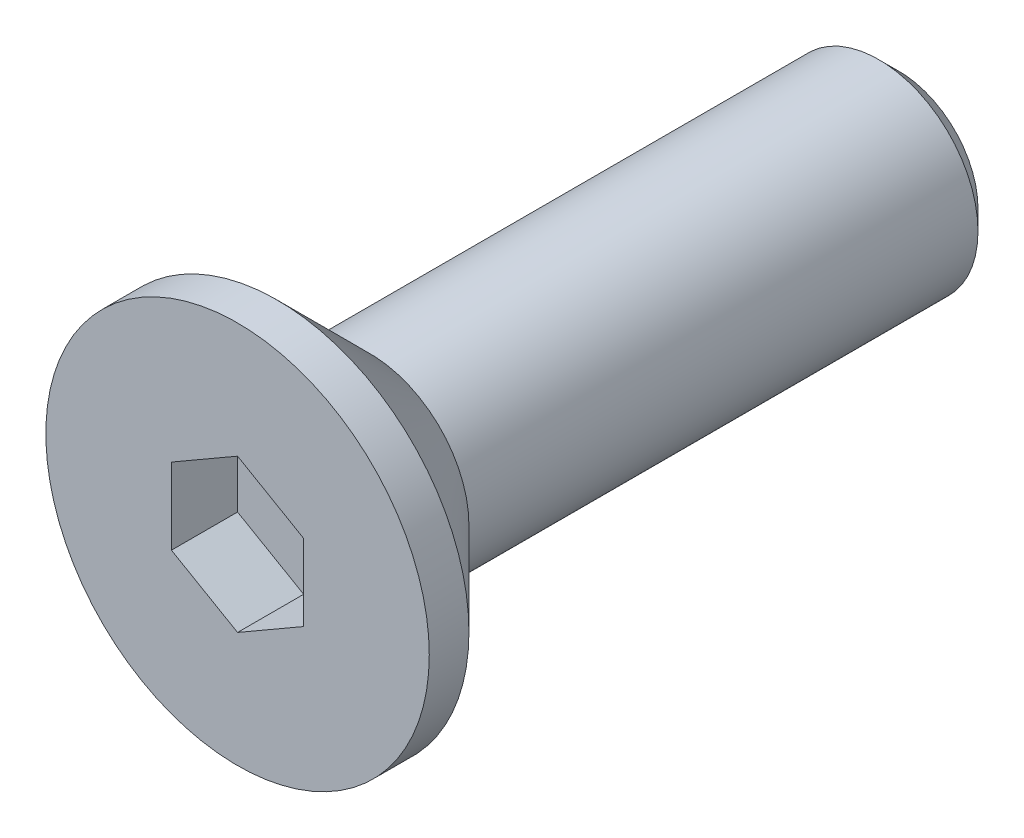
ISO-10303-21;
HEADER;
FILE_DESCRIPTION(('STEP AP214'),'2;1');
FILE_NAME('part.step','',(''),(''),'','','');
FILE_SCHEMA(('AUTOMOTIVE_DESIGN { 1 0 10303 214 1 1 1 1 }'));
ENDSEC;
DATA;
#1=APPLICATION_CONTEXT('core data for automotive mechanical design processes');
#2=APPLICATION_PROTOCOL_DEFINITION('international standard','automotive_design',2000,#1);
#3=PRODUCT_CONTEXT('',#1,'mechanical');
#4=PRODUCT('Part','Part','',(#3));
#5=PRODUCT_RELATED_PRODUCT_CATEGORY('part','',(#4));
#6=PRODUCT_DEFINITION_FORMATION('','',#4);
#7=PRODUCT_DEFINITION_CONTEXT('part definition',#1,'design');
#8=PRODUCT_DEFINITION('design','',#6,#7);
#9=PRODUCT_DEFINITION_SHAPE('','',#8);
#10=(LENGTH_UNIT() NAMED_UNIT(*) SI_UNIT(.MILLI.,.METRE.));
#11=(NAMED_UNIT(*) PLANE_ANGLE_UNIT() SI_UNIT($,.RADIAN.));
#12=(NAMED_UNIT(*) SI_UNIT($,.STERADIAN.) SOLID_ANGLE_UNIT());
#13=UNCERTAINTY_MEASURE_WITH_UNIT(LENGTH_MEASURE(1.E-05),#10,'distance_accuracy_value','');
#14=(GEOMETRIC_REPRESENTATION_CONTEXT(3) GLOBAL_UNCERTAINTY_ASSIGNED_CONTEXT((#13)) GLOBAL_UNIT_ASSIGNED_CONTEXT((#10,
#11,#12)) REPRESENTATION_CONTEXT('',''));
#15=CARTESIAN_POINT('',(0.,0.,0.));
#16=DIRECTION('',(0.,0.,1.));
#17=DIRECTION('',(1.,0.,0.));
#18=AXIS2_PLACEMENT_3D('',#15,#16,#17);
#19=CARTESIAN_POINT('',(0.,0.,0.));
#20=DIRECTION('',(0.,0.,-1.));
#21=DIRECTION('',(-1.,0.,0.));
#22=AXIS2_PLACEMENT_3D('',#19,#20,#21);
#23=PLANE('',#22);
#24=DIRECTION('',(0.,1.,0.));
#25=VECTOR('',#24,1.);
#26=CARTESIAN_POINT('',(1.,-0.577350269189626,0.));
#27=LINE('',#26,#25);
#28=CARTESIAN_POINT('',(1.,-0.577350269189626,0.));
#29=VERTEX_POINT('',#28);
#30=CARTESIAN_POINT('',(1.,0.577350269189626,0.));
#31=VERTEX_POINT('',#30);
#32=EDGE_CURVE('E128',#29,#31,#27,.T.);
#33=ORIENTED_EDGE('',*,*,#32,.F.);
#34=DIRECTION('',(0.866025403784439,0.5,0.));
#35=VECTOR('',#34,1.);
#36=CARTESIAN_POINT('',(0.,-1.15470053837925,0.));
#37=LINE('',#36,#35);
#38=CARTESIAN_POINT('',(0.,-1.15470053837925,0.));
#39=VERTEX_POINT('',#38);
#40=EDGE_CURVE('E54',#39,#29,#37,.T.);
#41=ORIENTED_EDGE('',*,*,#40,.F.);
#42=DIRECTION('',(0.866025403784439,-0.5,0.));
#43=VECTOR('',#42,1.);
#44=CARTESIAN_POINT('',(-1.,-0.577350269189626,0.));
#45=LINE('',#44,#43);
#46=CARTESIAN_POINT('',(-1.,-0.577350269189626,0.));
#47=VERTEX_POINT('',#46);
#48=EDGE_CURVE('E137',#47,#39,#45,.T.);
#49=ORIENTED_EDGE('',*,*,#48,.F.);
#50=DIRECTION('',(0.,-1.,0.));
#51=VECTOR('',#50,1.);
#52=CARTESIAN_POINT('',(-1.,0.577350269189626,0.));
#53=LINE('',#52,#51);
#54=CARTESIAN_POINT('',(-1.,0.577350269189626,0.));
#55=VERTEX_POINT('',#54);
#56=EDGE_CURVE('E135',#55,#47,#53,.T.);
#57=ORIENTED_EDGE('',*,*,#56,.F.);
#58=DIRECTION('',(-0.866025403784439,-0.5,0.));
#59=VECTOR('',#58,1.);
#60=CARTESIAN_POINT('',(0.,1.15470053837925,0.));
#61=LINE('',#60,#59);
#62=CARTESIAN_POINT('',(0.,1.15470053837925,0.));
#63=VERTEX_POINT('',#62);
#64=EDGE_CURVE('E102',#63,#55,#61,.T.);
#65=ORIENTED_EDGE('',*,*,#64,.F.);
#66=DIRECTION('',(-0.866025403784439,0.5,0.));
#67=VECTOR('',#66,1.);
#68=CARTESIAN_POINT('',(1.,0.577350269189626,0.));
#69=LINE('',#68,#67);
#70=EDGE_CURVE('E131',#31,#63,#69,.T.);
#71=ORIENTED_EDGE('',*,*,#70,.F.);
#72=EDGE_LOOP('',(#33,#41,#49,#57,#65,#71));
#73=FACE_BOUND('',#72,.T.);
#74=CARTESIAN_POINT('',(0.,0.,0.));
#75=DIRECTION('',(0.,0.,1.));
#76=DIRECTION('',(1.,0.,0.));
#77=AXIS2_PLACEMENT_3D('',#74,#75,#76);
#78=CIRCLE('',#77,2.9);
#79=CARTESIAN_POINT('',(2.9,0.,0.));
#80=VERTEX_POINT('',#79);
#81=EDGE_CURVE('E152',#80,#80,#78,.T.);
#82=ORIENTED_EDGE('',*,*,#81,.T.);
#83=EDGE_LOOP('',(#82));
#84=FACE_BOUND('',#83,.T.);
#85=ADVANCED_FACE('F39',(#73,#84),#23,.F.);
#86=CARTESIAN_POINT('',(0.,0.,31.7635815070186));
#87=DIRECTION('',(0.,0.,1.));
#88=DIRECTION('',(1.,0.,0.));
#89=AXIS2_PLACEMENT_3D('',#86,#87,#88);
#90=CYLINDRICAL_SURFACE('',#89,2.9);
#91=ORIENTED_EDGE('',*,*,#81,.F.);
#92=EDGE_LOOP('',(#91));
#93=FACE_BOUND('',#92,.T.);
#94=CARTESIAN_POINT('',(0.,0.,-0.60000000000001));
#95=DIRECTION('',(0.,0.,1.));
#96=DIRECTION('',(1.,0.,0.));
#97=AXIS2_PLACEMENT_3D('',#94,#95,#96);
#98=CIRCLE('',#97,2.9);
#99=CARTESIAN_POINT('',(2.9,0.,-0.60000000000001));
#100=VERTEX_POINT('',#99);
#101=EDGE_CURVE('E149',#100,#100,#98,.T.);
#102=ORIENTED_EDGE('',*,*,#101,.T.);
#103=EDGE_LOOP('',(#102));
#104=FACE_BOUND('',#103,.T.);
#105=ADVANCED_FACE('F169',(#93,#104),#90,.T.);
#106=CARTESIAN_POINT('',(0.,0.,-2.));
#107=DIRECTION('',(0.,0.,1.));
#108=DIRECTION('',(1.,0.,0.));
#109=AXIS2_PLACEMENT_3D('',#106,#107,#108);
#110=CONICAL_SURFACE('',#109,1.5,0.785398163397451);
#111=ORIENTED_EDGE('',*,*,#101,.F.);
#112=EDGE_LOOP('',(#111));
#113=FACE_BOUND('',#112,.T.);
#114=CARTESIAN_POINT('',(0.,0.,-2.));
#115=DIRECTION('',(0.,0.,1.));
#116=DIRECTION('',(1.,0.,0.));
#117=AXIS2_PLACEMENT_3D('',#114,#115,#116);
#118=CIRCLE('',#117,1.5);
#119=CARTESIAN_POINT('',(1.5,0.,-2.));
#120=VERTEX_POINT('',#119);
#121=EDGE_CURVE('E141',#120,#120,#118,.T.);
#122=ORIENTED_EDGE('',*,*,#121,.T.);
#123=EDGE_LOOP('',(#122));
#124=FACE_BOUND('',#123,.T.);
#125=ADVANCED_FACE('F174',(#113,#124),#110,.T.);
#126=CARTESIAN_POINT('',(0.,0.,31.7635815070186));
#127=DIRECTION('',(0.,0.,1.));
#128=DIRECTION('',(1.,0.,0.));
#129=AXIS2_PLACEMENT_3D('',#126,#127,#128);
#130=CYLINDRICAL_SURFACE('',#129,1.5);
#131=CARTESIAN_POINT('',(0.,0.,-9.7));
#132=DIRECTION('',(0.,0.,1.));
#133=DIRECTION('',(1.,0.,0.));
#134=AXIS2_PLACEMENT_3D('',#131,#132,#133);
#135=CIRCLE('',#134,1.5);
#136=CARTESIAN_POINT('',(1.5,0.,-9.7));
#137=VERTEX_POINT('',#136);
#138=EDGE_CURVE('E47',#137,#137,#135,.T.);
#139=ORIENTED_EDGE('',*,*,#138,.T.);
#140=EDGE_LOOP('',(#139));
#141=FACE_BOUND('',#140,.T.);
#142=ORIENTED_EDGE('',*,*,#121,.F.);
#143=EDGE_LOOP('',(#142));
#144=FACE_BOUND('',#143,.T.);
#145=ADVANCED_FACE('F157',(#141,#144),#130,.T.);
#146=CARTESIAN_POINT('',(0.,1.5,-10.));
#147=DIRECTION('',(0.,0.,1.));
#148=DIRECTION('',(1.,0.,0.));
#149=AXIS2_PLACEMENT_3D('',#146,#147,#148);
#150=PLANE('',#149);
#151=CARTESIAN_POINT('',(0.,0.,-10.));
#152=DIRECTION('',(0.,0.,1.));
#153=DIRECTION('',(1.,0.,0.));
#154=AXIS2_PLACEMENT_3D('',#151,#152,#153);
#155=CIRCLE('',#154,1.19999999999999);
#156=CARTESIAN_POINT('',(1.19999999999999,0.,-10.));
#157=VERTEX_POINT('',#156);
#158=EDGE_CURVE('E11',#157,#157,#155,.F.);
#159=ORIENTED_EDGE('',*,*,#158,.T.);
#160=EDGE_LOOP('',(#159));
#161=FACE_BOUND('',#160,.T.);
#162=ADVANCED_FACE('F185',(#161),#150,.F.);
#163=CARTESIAN_POINT('',(0.,-1.15470053837925,-1.));
#164=DIRECTION('',(0.5,-0.866025403784439,0.));
#165=DIRECTION('',(0.866025403784439,0.5,0.));
#166=AXIS2_PLACEMENT_3D('',#163,#164,#165);
#167=PLANE('',#166);
#168=ORIENTED_EDGE('',*,*,#40,.T.);
#169=DIRECTION('',(0.,0.,1.));
#170=VECTOR('',#169,1.);
#171=CARTESIAN_POINT('',(1.,-0.577350269189626,-1.));
#172=LINE('',#171,#170);
#173=CARTESIAN_POINT('',(1.,-0.577350269189626,-1.));
#174=VERTEX_POINT('',#173);
#175=EDGE_CURVE('E84',#174,#29,#172,.T.);
#176=ORIENTED_EDGE('',*,*,#175,.F.);
#177=DIRECTION('',(0.866025403784439,0.5,0.));
#178=VECTOR('',#177,1.);
#179=CARTESIAN_POINT('',(0.,-1.15470053837925,-1.));
#180=LINE('',#179,#178);
#181=CARTESIAN_POINT('',(0.,-1.15470053837925,-1.));
#182=VERTEX_POINT('',#181);
#183=EDGE_CURVE('E139',#182,#174,#180,.T.);
#184=ORIENTED_EDGE('',*,*,#183,.F.);
#185=DIRECTION('',(0.,0.,1.));
#186=VECTOR('',#185,1.);
#187=CARTESIAN_POINT('',(0.,-1.15470053837925,-1.));
#188=LINE('',#187,#186);
#189=EDGE_CURVE('E62',#182,#39,#188,.T.);
#190=ORIENTED_EDGE('',*,*,#189,.T.);
#191=EDGE_LOOP('',(#168,#176,#184,#190));
#192=FACE_BOUND('',#191,.T.);
#193=ADVANCED_FACE('F188',(#192),#167,.F.);
#194=CARTESIAN_POINT('',(-1.,-0.577350269189626,-1.));
#195=DIRECTION('',(-0.5,-0.866025403784439,0.));
#196=DIRECTION('',(0.866025403784439,-0.5,0.));
#197=AXIS2_PLACEMENT_3D('',#194,#195,#196);
#198=PLANE('',#197);
#199=ORIENTED_EDGE('',*,*,#48,.T.);
#200=ORIENTED_EDGE('',*,*,#189,.F.);
#201=DIRECTION('',(0.866025403784439,-0.5,0.));
#202=VECTOR('',#201,1.);
#203=CARTESIAN_POINT('',(-1.,-0.577350269189626,-1.));
#204=LINE('',#203,#202);
#205=CARTESIAN_POINT('',(-1.,-0.577350269189626,-1.));
#206=VERTEX_POINT('',#205);
#207=EDGE_CURVE('E114',#206,#182,#204,.T.);
#208=ORIENTED_EDGE('',*,*,#207,.F.);
#209=DIRECTION('',(0.,0.,1.));
#210=VECTOR('',#209,1.);
#211=CARTESIAN_POINT('',(-1.,-0.577350269189626,-1.));
#212=LINE('',#211,#210);
#213=EDGE_CURVE('E106',#206,#47,#212,.T.);
#214=ORIENTED_EDGE('',*,*,#213,.T.);
#215=EDGE_LOOP('',(#199,#200,#208,#214));
#216=FACE_BOUND('',#215,.T.);
#217=ADVANCED_FACE('F192',(#216),#198,.F.);
#218=CARTESIAN_POINT('',(-1.,0.577350269189626,-1.));
#219=DIRECTION('',(-1.,0.,0.));
#220=DIRECTION('',(0.,-1.,0.));
#221=AXIS2_PLACEMENT_3D('',#218,#219,#220);
#222=PLANE('',#221);
#223=ORIENTED_EDGE('',*,*,#56,.T.);
#224=ORIENTED_EDGE('',*,*,#213,.F.);
#225=DIRECTION('',(0.,-1.,0.));
#226=VECTOR('',#225,1.);
#227=CARTESIAN_POINT('',(-1.,0.577350269189626,-1.));
#228=LINE('',#227,#226);
#229=CARTESIAN_POINT('',(-1.,0.577350269189626,-1.));
#230=VERTEX_POINT('',#229);
#231=EDGE_CURVE('E110',#230,#206,#228,.T.);
#232=ORIENTED_EDGE('',*,*,#231,.F.);
#233=DIRECTION('',(0.,0.,1.));
#234=VECTOR('',#233,1.);
#235=CARTESIAN_POINT('',(-1.,0.577350269189626,-1.));
#236=LINE('',#235,#234);
#237=EDGE_CURVE('E95',#230,#55,#236,.T.);
#238=ORIENTED_EDGE('',*,*,#237,.T.);
#239=EDGE_LOOP('',(#223,#224,#232,#238));
#240=FACE_BOUND('',#239,.T.);
#241=ADVANCED_FACE('F111',(#240),#222,.F.);
#242=CARTESIAN_POINT('',(0.,1.15470053837925,-1.));
#243=DIRECTION('',(-0.5,0.866025403784439,0.));
#244=DIRECTION('',(-0.866025403784439,-0.5,0.));
#245=AXIS2_PLACEMENT_3D('',#242,#243,#244);
#246=PLANE('',#245);
#247=ORIENTED_EDGE('',*,*,#64,.T.);
#248=ORIENTED_EDGE('',*,*,#237,.F.);
#249=DIRECTION('',(-0.866025403784439,-0.5,0.));
#250=VECTOR('',#249,1.);
#251=CARTESIAN_POINT('',(0.,1.15470053837925,-1.));
#252=LINE('',#251,#250);
#253=CARTESIAN_POINT('',(0.,1.15470053837925,-1.));
#254=VERTEX_POINT('',#253);
#255=EDGE_CURVE('E99',#254,#230,#252,.T.);
#256=ORIENTED_EDGE('',*,*,#255,.F.);
#257=DIRECTION('',(0.,0.,1.));
#258=VECTOR('',#257,1.);
#259=CARTESIAN_POINT('',(0.,1.15470053837925,-1.));
#260=LINE('',#259,#258);
#261=EDGE_CURVE('E107',#254,#63,#260,.T.);
#262=ORIENTED_EDGE('',*,*,#261,.T.);
#263=EDGE_LOOP('',(#247,#248,#256,#262));
#264=FACE_BOUND('',#263,.T.);
#265=ADVANCED_FACE('F97',(#264),#246,.F.);
#266=CARTESIAN_POINT('',(1.,0.577350269189626,-1.));
#267=DIRECTION('',(0.5,0.866025403784439,0.));
#268=DIRECTION('',(-0.866025403784439,0.5,0.));
#269=AXIS2_PLACEMENT_3D('',#266,#267,#268);
#270=PLANE('',#269);
#271=ORIENTED_EDGE('',*,*,#70,.T.);
#272=ORIENTED_EDGE('',*,*,#261,.F.);
#273=DIRECTION('',(-0.866025403784439,0.5,0.));
#274=VECTOR('',#273,1.);
#275=CARTESIAN_POINT('',(1.,0.577350269189626,-1.));
#276=LINE('',#275,#274);
#277=CARTESIAN_POINT('',(1.,0.577350269189626,-1.));
#278=VERTEX_POINT('',#277);
#279=EDGE_CURVE('E120',#278,#254,#276,.T.);
#280=ORIENTED_EDGE('',*,*,#279,.F.);
#281=DIRECTION('',(0.,0.,1.));
#282=VECTOR('',#281,1.);
#283=CARTESIAN_POINT('',(1.,0.577350269189626,-1.));
#284=LINE('',#283,#282);
#285=EDGE_CURVE('E144',#278,#31,#284,.T.);
#286=ORIENTED_EDGE('',*,*,#285,.T.);
#287=EDGE_LOOP('',(#271,#272,#280,#286));
#288=FACE_BOUND('',#287,.T.);
#289=ADVANCED_FACE('F195',(#288),#270,.F.);
#290=CARTESIAN_POINT('',(1.,-0.577350269189626,-1.));
#291=DIRECTION('',(1.,0.,0.));
#292=DIRECTION('',(0.,1.,0.));
#293=AXIS2_PLACEMENT_3D('',#290,#291,#292);
#294=PLANE('',#293);
#295=ORIENTED_EDGE('',*,*,#32,.T.);
#296=ORIENTED_EDGE('',*,*,#285,.F.);
#297=DIRECTION('',(0.,1.,0.));
#298=VECTOR('',#297,1.);
#299=CARTESIAN_POINT('',(1.,-0.577350269189626,-1.));
#300=LINE('',#299,#298);
#301=EDGE_CURVE('E122',#174,#278,#300,.T.);
#302=ORIENTED_EDGE('',*,*,#301,.F.);
#303=ORIENTED_EDGE('',*,*,#175,.T.);
#304=EDGE_LOOP('',(#295,#296,#302,#303));
#305=FACE_BOUND('',#304,.T.);
#306=ADVANCED_FACE('F165',(#305),#294,.F.);
#307=CARTESIAN_POINT('',(0.,0.,-1.));
#308=DIRECTION('',(0.,0.,1.));
#309=DIRECTION('',(1.,0.,0.));
#310=AXIS2_PLACEMENT_3D('',#307,#308,#309);
#311=PLANE('',#310);
#312=ORIENTED_EDGE('',*,*,#183,.T.);
#313=ORIENTED_EDGE('',*,*,#301,.T.);
#314=ORIENTED_EDGE('',*,*,#279,.T.);
#315=ORIENTED_EDGE('',*,*,#255,.T.);
#316=ORIENTED_EDGE('',*,*,#231,.T.);
#317=ORIENTED_EDGE('',*,*,#207,.T.);
#318=EDGE_LOOP('',(#312,#313,#314,#315,#316,#317));
#319=FACE_BOUND('',#318,.T.);
#320=ADVANCED_FACE('F117',(#319),#311,.T.);
#321=CARTESIAN_POINT('',(0.,0.,-9.7));
#322=DIRECTION('',(0.,0.,1.));
#323=DIRECTION('',(1.,0.,0.));
#324=AXIS2_PLACEMENT_3D('',#321,#322,#323);
#325=CONICAL_SURFACE('',#324,1.5,0.785398163397453);
#326=ORIENTED_EDGE('',*,*,#158,.F.);
#327=EDGE_LOOP('',(#326));
#328=FACE_BOUND('',#327,.T.);
#329=ORIENTED_EDGE('',*,*,#138,.F.);
#330=EDGE_LOOP('',(#329));
#331=FACE_BOUND('',#330,.T.);
#332=ADVANCED_FACE('F41',(#328,#331),#325,.T.);
#333=CLOSED_SHELL('',(#85,#105,#125,#145,#162,#193,#217,#241,#265,#289,#306,#320,#332));
#334=MANIFOLD_SOLID_BREP('B2',#333);
#335=ADVANCED_BREP_SHAPE_REPRESENTATION('',(#18,#334),#14);
#336=SHAPE_DEFINITION_REPRESENTATION(#9,#335);
ENDSEC;
END-ISO-10303-21;
